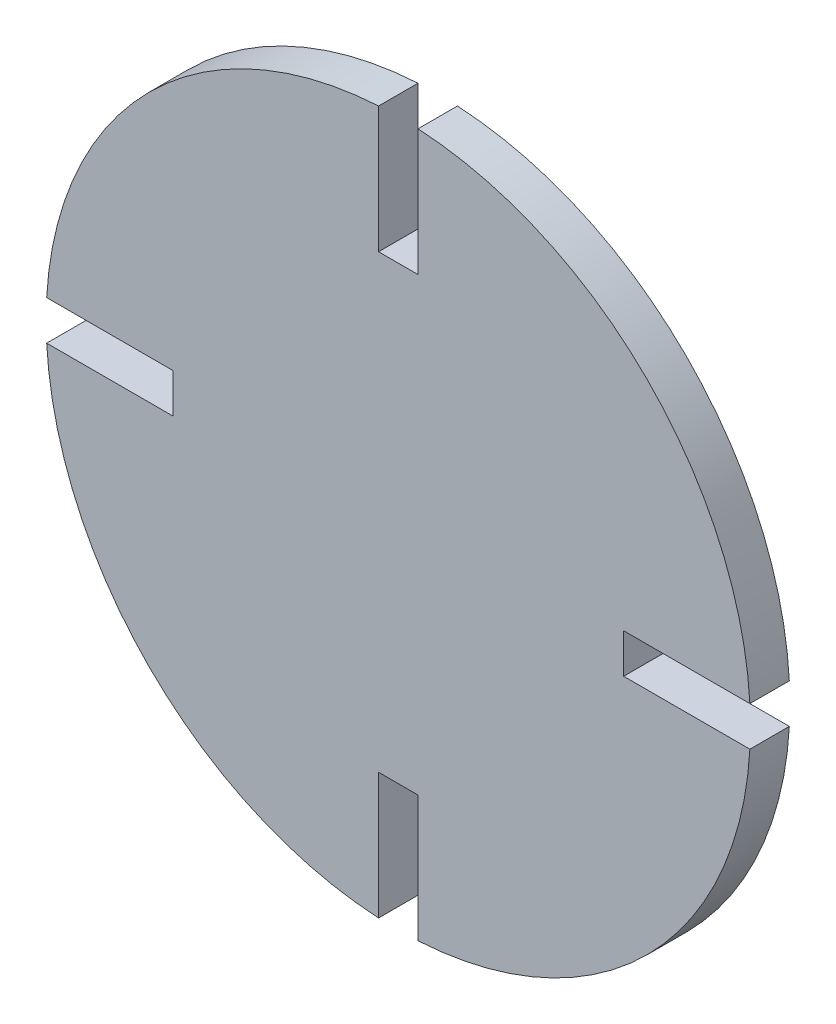
ISO-10303-21;
HEADER;
FILE_DESCRIPTION(('STEP AP214'),'2;1');
FILE_NAME('part.step','',(''),(''),'','','');
FILE_SCHEMA(('AUTOMOTIVE_DESIGN { 1 0 10303 214 1 1 1 1 }'));
ENDSEC;
DATA;
#1=APPLICATION_CONTEXT('core data for automotive mechanical design processes');
#2=APPLICATION_PROTOCOL_DEFINITION('international standard','automotive_design',2000,#1);
#3=PRODUCT_CONTEXT('',#1,'mechanical');
#4=PRODUCT('Part','Part','',(#3));
#5=PRODUCT_RELATED_PRODUCT_CATEGORY('part','',(#4));
#6=PRODUCT_DEFINITION_FORMATION('','',#4);
#7=PRODUCT_DEFINITION_CONTEXT('part definition',#1,'design');
#8=PRODUCT_DEFINITION('design','',#6,#7);
#9=PRODUCT_DEFINITION_SHAPE('','',#8);
#10=(LENGTH_UNIT() NAMED_UNIT(*) SI_UNIT(.MILLI.,.METRE.));
#11=(NAMED_UNIT(*) PLANE_ANGLE_UNIT() SI_UNIT($,.RADIAN.));
#12=(NAMED_UNIT(*) SI_UNIT($,.STERADIAN.) SOLID_ANGLE_UNIT());
#13=UNCERTAINTY_MEASURE_WITH_UNIT(LENGTH_MEASURE(1.E-05),#10,'distance_accuracy_value','');
#14=(GEOMETRIC_REPRESENTATION_CONTEXT(3) GLOBAL_UNCERTAINTY_ASSIGNED_CONTEXT((#13)) GLOBAL_UNIT_ASSIGNED_CONTEXT((#10,
#11,#12)) REPRESENTATION_CONTEXT('',''));
#15=CARTESIAN_POINT('',(0.,0.,0.));
#16=DIRECTION('',(0.,0.,1.));
#17=DIRECTION('',(1.,0.,0.));
#18=AXIS2_PLACEMENT_3D('',#15,#16,#17);
#19=CARTESIAN_POINT('',(0.,0.,2.8));
#20=DIRECTION('',(0.,0.,-1.));
#21=DIRECTION('',(-1.,0.,0.));
#22=AXIS2_PLACEMENT_3D('',#19,#20,#21);
#23=CYLINDRICAL_SURFACE('',#22,25.);
#24=DIRECTION('',(0.,0.,-1.));
#25=VECTOR('',#24,1.);
#26=CARTESIAN_POINT('',(-24.9607692189163,1.39999999999991,2.8));
#27=LINE('',#26,#25);
#28=CARTESIAN_POINT('',(-24.9607692189163,1.39999999999991,2.8));
#29=VERTEX_POINT('',#28);
#30=CARTESIAN_POINT('',(-24.9607692189163,1.39999999999991,0.));
#31=VERTEX_POINT('',#30);
#32=EDGE_CURVE('E215',#29,#31,#27,.T.);
#33=ORIENTED_EDGE('',*,*,#32,.F.);
#34=CARTESIAN_POINT('',(0.,0.,2.8));
#35=DIRECTION('',(0.,0.,1.));
#36=DIRECTION('',(1.,0.,0.));
#37=AXIS2_PLACEMENT_3D('',#34,#35,#36);
#38=CIRCLE('',#37,25.);
#39=CARTESIAN_POINT('',(-1.4,24.9607692189163,2.8));
#40=VERTEX_POINT('',#39);
#41=EDGE_CURVE('E241',#40,#29,#38,.T.);
#42=ORIENTED_EDGE('',*,*,#41,.F.);
#43=DIRECTION('',(0.,0.,-1.));
#44=VECTOR('',#43,1.);
#45=CARTESIAN_POINT('',(-1.4,24.9607692189163,2.8));
#46=LINE('',#45,#44);
#47=CARTESIAN_POINT('',(-1.4,24.9607692189163,0.));
#48=VERTEX_POINT('',#47);
#49=EDGE_CURVE('E235',#48,#40,#46,.F.);
#50=ORIENTED_EDGE('',*,*,#49,.F.);
#51=CARTESIAN_POINT('',(0.,0.,0.));
#52=DIRECTION('',(0.,0.,1.));
#53=DIRECTION('',(1.,0.,0.));
#54=AXIS2_PLACEMENT_3D('',#51,#52,#53);
#55=CIRCLE('',#54,25.);
#56=EDGE_CURVE('E246',#48,#31,#55,.T.);
#57=ORIENTED_EDGE('',*,*,#56,.T.);
#58=EDGE_LOOP('',(#33,#42,#50,#57));
#59=FACE_BOUND('',#58,.T.);
#60=ADVANCED_FACE('F33',(#59),#23,.T.);
#61=DIRECTION('',(0.,0.,-1.));
#62=VECTOR('',#61,1.);
#63=CARTESIAN_POINT('',(-24.9607692189163,-1.40000000000009,2.8));
#64=LINE('',#63,#62);
#65=CARTESIAN_POINT('',(-24.9607692189163,-1.40000000000009,0.));
#66=VERTEX_POINT('',#65);
#67=CARTESIAN_POINT('',(-24.9607692189163,-1.40000000000009,2.8));
#68=VERTEX_POINT('',#67);
#69=EDGE_CURVE('E151',#66,#68,#64,.F.);
#70=ORIENTED_EDGE('',*,*,#69,.F.);
#71=CARTESIAN_POINT('',(-1.4,-24.9607692189163,0.));
#72=VERTEX_POINT('',#71);
#73=EDGE_CURVE('E249',#66,#72,#55,.T.);
#74=ORIENTED_EDGE('',*,*,#73,.T.);
#75=DIRECTION('',(0.,0.,-1.));
#76=VECTOR('',#75,1.);
#77=CARTESIAN_POINT('',(-1.4,-24.9607692189163,2.8));
#78=LINE('',#77,#76);
#79=CARTESIAN_POINT('',(-1.4,-24.9607692189163,2.8));
#80=VERTEX_POINT('',#79);
#81=EDGE_CURVE('E212',#80,#72,#78,.T.);
#82=ORIENTED_EDGE('',*,*,#81,.F.);
#83=EDGE_CURVE('E244',#68,#80,#38,.T.);
#84=ORIENTED_EDGE('',*,*,#83,.F.);
#85=EDGE_LOOP('',(#70,#74,#82,#84));
#86=FACE_BOUND('',#85,.T.);
#87=ADVANCED_FACE('F297',(#86),#23,.T.);
#88=DIRECTION('',(0.,0.,-1.));
#89=VECTOR('',#88,1.);
#90=CARTESIAN_POINT('',(1.4,-24.9607692189163,2.8));
#91=LINE('',#90,#89);
#92=CARTESIAN_POINT('',(1.4,-24.9607692189163,0.));
#93=VERTEX_POINT('',#92);
#94=CARTESIAN_POINT('',(1.4,-24.9607692189163,2.8));
#95=VERTEX_POINT('',#94);
#96=EDGE_CURVE('E210',#93,#95,#91,.F.);
#97=ORIENTED_EDGE('',*,*,#96,.F.);
#98=CARTESIAN_POINT('',(24.9607692189163,-1.39999999999974,0.));
#99=VERTEX_POINT('',#98);
#100=EDGE_CURVE('E266',#93,#99,#55,.T.);
#101=ORIENTED_EDGE('',*,*,#100,.T.);
#102=DIRECTION('',(0.,0.,-1.));
#103=VECTOR('',#102,1.);
#104=CARTESIAN_POINT('',(24.9607692189163,-1.39999999999974,2.8));
#105=LINE('',#104,#103);
#106=CARTESIAN_POINT('',(24.9607692189163,-1.39999999999974,2.8));
#107=VERTEX_POINT('',#106);
#108=EDGE_CURVE('E208',#107,#99,#105,.T.);
#109=ORIENTED_EDGE('',*,*,#108,.F.);
#110=EDGE_CURVE('E268',#95,#107,#38,.T.);
#111=ORIENTED_EDGE('',*,*,#110,.F.);
#112=EDGE_LOOP('',(#97,#101,#109,#111));
#113=FACE_BOUND('',#112,.T.);
#114=ADVANCED_FACE('F264',(#113),#23,.T.);
#115=DIRECTION('',(0.,0.,-1.));
#116=VECTOR('',#115,1.);
#117=CARTESIAN_POINT('',(24.9607692189163,1.40000000000026,2.8));
#118=LINE('',#117,#116);
#119=CARTESIAN_POINT('',(24.9607692189163,1.40000000000026,0.));
#120=VERTEX_POINT('',#119);
#121=CARTESIAN_POINT('',(24.9607692189163,1.40000000000026,2.8));
#122=VERTEX_POINT('',#121);
#123=EDGE_CURVE('E164',#120,#122,#118,.F.);
#124=ORIENTED_EDGE('',*,*,#123,.F.);
#125=CARTESIAN_POINT('',(1.4,24.9607692189163,0.));
#126=VERTEX_POINT('',#125);
#127=EDGE_CURVE('E240',#120,#126,#55,.T.);
#128=ORIENTED_EDGE('',*,*,#127,.T.);
#129=DIRECTION('',(0.,0.,-1.));
#130=VECTOR('',#129,1.);
#131=CARTESIAN_POINT('',(1.4,24.9607692189163,2.8));
#132=LINE('',#131,#130);
#133=CARTESIAN_POINT('',(1.4,24.9607692189163,2.8));
#134=VERTEX_POINT('',#133);
#135=EDGE_CURVE('E237',#134,#126,#132,.T.);
#136=ORIENTED_EDGE('',*,*,#135,.F.);
#137=EDGE_CURVE('E245',#122,#134,#38,.T.);
#138=ORIENTED_EDGE('',*,*,#137,.F.);
#139=EDGE_LOOP('',(#124,#128,#136,#138));
#140=FACE_BOUND('',#139,.T.);
#141=ADVANCED_FACE('F275',(#140),#23,.T.);
#142=CARTESIAN_POINT('',(0.,0.,2.8));
#143=DIRECTION('',(0.,0.,1.));
#144=DIRECTION('',(1.,0.,0.));
#145=AXIS2_PLACEMENT_3D('',#142,#143,#144);
#146=PLANE('',#145);
#147=ORIENTED_EDGE('',*,*,#41,.T.);
#148=DIRECTION('',(-1.,0.,0.));
#149=VECTOR('',#148,1.);
#150=CARTESIAN_POINT('',(-34.,1.39999999999988,2.8));
#151=LINE('',#150,#149);
#152=CARTESIAN_POINT('',(-16.,1.39999999999995,2.8));
#153=VERTEX_POINT('',#152);
#154=EDGE_CURVE('E157',#153,#29,#151,.T.);
#155=ORIENTED_EDGE('',*,*,#154,.F.);
#156=DIRECTION('',(0.,1.,0.));
#157=VECTOR('',#156,1.);
#158=CARTESIAN_POINT('',(-16.,-1.40000000000005,2.8));
#159=LINE('',#158,#157);
#160=CARTESIAN_POINT('',(-16.,-1.40000000000005,2.8));
#161=VERTEX_POINT('',#160);
#162=EDGE_CURVE('E156',#161,#153,#159,.T.);
#163=ORIENTED_EDGE('',*,*,#162,.F.);
#164=DIRECTION('',(1.,0.,0.));
#165=VECTOR('',#164,1.);
#166=CARTESIAN_POINT('',(-34.,-1.40000000000012,2.8));
#167=LINE('',#166,#165);
#168=EDGE_CURVE('E145',#68,#161,#167,.T.);
#169=ORIENTED_EDGE('',*,*,#168,.F.);
#170=ORIENTED_EDGE('',*,*,#83,.T.);
#171=DIRECTION('',(0.,-1.,0.));
#172=VECTOR('',#171,1.);
#173=CARTESIAN_POINT('',(-1.4,-34.,2.8));
#174=LINE('',#173,#172);
#175=CARTESIAN_POINT('',(-1.4,-16.,2.8));
#176=VERTEX_POINT('',#175);
#177=EDGE_CURVE('E177',#176,#80,#174,.T.);
#178=ORIENTED_EDGE('',*,*,#177,.F.);
#179=DIRECTION('',(-1.,0.,0.));
#180=VECTOR('',#179,1.);
#181=CARTESIAN_POINT('',(1.4,-16.,2.8));
#182=LINE('',#181,#180);
#183=CARTESIAN_POINT('',(1.4,-16.,2.8));
#184=VERTEX_POINT('',#183);
#185=EDGE_CURVE('E182',#184,#176,#182,.T.);
#186=ORIENTED_EDGE('',*,*,#185,.F.);
#187=DIRECTION('',(0.,1.,0.));
#188=VECTOR('',#187,1.);
#189=CARTESIAN_POINT('',(1.4,-34.,2.8));
#190=LINE('',#189,#188);
#191=EDGE_CURVE('E179',#95,#184,#190,.T.);
#192=ORIENTED_EDGE('',*,*,#191,.F.);
#193=ORIENTED_EDGE('',*,*,#110,.T.);
#194=DIRECTION('',(1.,0.,0.));
#195=VECTOR('',#194,1.);
#196=CARTESIAN_POINT('',(34.,-1.39999999999964,2.8));
#197=LINE('',#196,#195);
#198=CARTESIAN_POINT('',(16.,-1.39999999999983,2.8));
#199=VERTEX_POINT('',#198);
#200=EDGE_CURVE('E191',#199,#107,#197,.T.);
#201=ORIENTED_EDGE('',*,*,#200,.F.);
#202=DIRECTION('',(0.,-1.,0.));
#203=VECTOR('',#202,1.);
#204=CARTESIAN_POINT('',(16.,1.40000000000017,2.8));
#205=LINE('',#204,#203);
#206=CARTESIAN_POINT('',(16.,1.40000000000017,2.8));
#207=VERTEX_POINT('',#206);
#208=EDGE_CURVE('E196',#207,#199,#205,.T.);
#209=ORIENTED_EDGE('',*,*,#208,.F.);
#210=DIRECTION('',(-1.,0.,0.));
#211=VECTOR('',#210,1.);
#212=CARTESIAN_POINT('',(34.,1.40000000000036,2.8));
#213=LINE('',#212,#211);
#214=EDGE_CURVE('E193',#122,#207,#213,.T.);
#215=ORIENTED_EDGE('',*,*,#214,.F.);
#216=ORIENTED_EDGE('',*,*,#137,.T.);
#217=DIRECTION('',(0.,1.,0.));
#218=VECTOR('',#217,1.);
#219=CARTESIAN_POINT('',(1.4,34.,2.8));
#220=LINE('',#219,#218);
#221=CARTESIAN_POINT('',(1.4,16.,2.8));
#222=VERTEX_POINT('',#221);
#223=EDGE_CURVE('E218',#222,#134,#220,.T.);
#224=ORIENTED_EDGE('',*,*,#223,.F.);
#225=DIRECTION('',(1.,0.,0.));
#226=VECTOR('',#225,1.);
#227=CARTESIAN_POINT('',(-1.4,16.,2.8));
#228=LINE('',#227,#226);
#229=CARTESIAN_POINT('',(-1.4,16.,2.8));
#230=VERTEX_POINT('',#229);
#231=EDGE_CURVE('E224',#230,#222,#228,.T.);
#232=ORIENTED_EDGE('',*,*,#231,.F.);
#233=DIRECTION('',(0.,-1.,0.));
#234=VECTOR('',#233,1.);
#235=CARTESIAN_POINT('',(-1.4,34.,2.8));
#236=LINE('',#235,#234);
#237=EDGE_CURVE('E221',#40,#230,#236,.T.);
#238=ORIENTED_EDGE('',*,*,#237,.F.);
#239=EDGE_LOOP('',(#147,#155,#163,#169,#170,#178,#186,#192,#193,#201,#209,#215,#216,#224,#232,#238));
#240=FACE_BOUND('',#239,.T.);
#241=ADVANCED_FACE('F169',(#240),#146,.T.);
#242=CARTESIAN_POINT('',(0.,0.,0.));
#243=DIRECTION('',(0.,0.,1.));
#244=DIRECTION('',(1.,0.,0.));
#245=AXIS2_PLACEMENT_3D('',#242,#243,#244);
#246=PLANE('',#245);
#247=DIRECTION('',(-1.,0.,0.));
#248=VECTOR('',#247,1.);
#249=CARTESIAN_POINT('',(-34.,1.39999999999988,0.));
#250=LINE('',#249,#248);
#251=CARTESIAN_POINT('',(-16.,1.39999999999995,0.));
#252=VERTEX_POINT('',#251);
#253=EDGE_CURVE('E47',#252,#31,#250,.T.);
#254=ORIENTED_EDGE('',*,*,#253,.T.);
#255=ORIENTED_EDGE('',*,*,#56,.F.);
#256=DIRECTION('',(0.,1.,0.));
#257=VECTOR('',#256,1.);
#258=CARTESIAN_POINT('',(-1.4,0.,0.));
#259=LINE('',#258,#257);
#260=CARTESIAN_POINT('',(-1.4,16.,0.));
#261=VERTEX_POINT('',#260);
#262=EDGE_CURVE('E243',#261,#48,#259,.T.);
#263=ORIENTED_EDGE('',*,*,#262,.F.);
#264=DIRECTION('',(1.,0.,0.));
#265=VECTOR('',#264,1.);
#266=CARTESIAN_POINT('',(-1.4,16.,0.));
#267=LINE('',#266,#265);
#268=CARTESIAN_POINT('',(1.4,16.,0.));
#269=VERTEX_POINT('',#268);
#270=EDGE_CURVE('E222',#261,#269,#267,.T.);
#271=ORIENTED_EDGE('',*,*,#270,.T.);
#272=DIRECTION('',(0.,1.,0.));
#273=VECTOR('',#272,1.);
#274=CARTESIAN_POINT('',(1.4,34.,0.));
#275=LINE('',#274,#273);
#276=EDGE_CURVE('E217',#269,#126,#275,.T.);
#277=ORIENTED_EDGE('',*,*,#276,.T.);
#278=ORIENTED_EDGE('',*,*,#127,.F.);
#279=DIRECTION('',(1.,0.,0.));
#280=VECTOR('',#279,1.);
#281=CARTESIAN_POINT('',(0.,1.4,0.));
#282=LINE('',#281,#280);
#283=CARTESIAN_POINT('',(16.,1.40000000000017,0.));
#284=VERTEX_POINT('',#283);
#285=EDGE_CURVE('E251',#284,#120,#282,.T.);
#286=ORIENTED_EDGE('',*,*,#285,.F.);
#287=DIRECTION('',(0.,-1.,0.));
#288=VECTOR('',#287,1.);
#289=CARTESIAN_POINT('',(16.,1.40000000000017,0.));
#290=LINE('',#289,#288);
#291=CARTESIAN_POINT('',(16.,-1.39999999999983,0.));
#292=VERTEX_POINT('',#291);
#293=EDGE_CURVE('E194',#284,#292,#290,.T.);
#294=ORIENTED_EDGE('',*,*,#293,.T.);
#295=DIRECTION('',(1.,0.,0.));
#296=VECTOR('',#295,1.);
#297=CARTESIAN_POINT('',(34.,-1.39999999999964,0.));
#298=LINE('',#297,#296);
#299=EDGE_CURVE('E199',#292,#99,#298,.T.);
#300=ORIENTED_EDGE('',*,*,#299,.T.);
#301=ORIENTED_EDGE('',*,*,#100,.F.);
#302=DIRECTION('',(0.,-1.,0.));
#303=VECTOR('',#302,1.);
#304=CARTESIAN_POINT('',(1.4,0.,0.));
#305=LINE('',#304,#303);
#306=CARTESIAN_POINT('',(1.4,-16.,0.));
#307=VERTEX_POINT('',#306);
#308=EDGE_CURVE('E40',#307,#93,#305,.T.);
#309=ORIENTED_EDGE('',*,*,#308,.F.);
#310=DIRECTION('',(-1.,0.,0.));
#311=VECTOR('',#310,1.);
#312=CARTESIAN_POINT('',(1.4,-16.,0.));
#313=LINE('',#312,#311);
#314=CARTESIAN_POINT('',(-1.4,-16.,0.));
#315=VERTEX_POINT('',#314);
#316=EDGE_CURVE('E180',#307,#315,#313,.T.);
#317=ORIENTED_EDGE('',*,*,#316,.T.);
#318=DIRECTION('',(0.,-1.,0.));
#319=VECTOR('',#318,1.);
#320=CARTESIAN_POINT('',(-1.4,-34.,0.));
#321=LINE('',#320,#319);
#322=EDGE_CURVE('E55',#315,#72,#321,.T.);
#323=ORIENTED_EDGE('',*,*,#322,.T.);
#324=ORIENTED_EDGE('',*,*,#73,.F.);
#325=DIRECTION('',(-1.,0.,0.));
#326=VECTOR('',#325,1.);
#327=CARTESIAN_POINT('',(0.,-1.4,0.));
#328=LINE('',#327,#326);
#329=CARTESIAN_POINT('',(-16.,-1.40000000000005,0.));
#330=VERTEX_POINT('',#329);
#331=EDGE_CURVE('E11',#330,#66,#328,.T.);
#332=ORIENTED_EDGE('',*,*,#331,.F.);
#333=DIRECTION('',(0.,1.,0.));
#334=VECTOR('',#333,1.);
#335=CARTESIAN_POINT('',(-16.,-1.40000000000005,0.));
#336=LINE('',#335,#334);
#337=EDGE_CURVE('E162',#330,#252,#336,.T.);
#338=ORIENTED_EDGE('',*,*,#337,.T.);
#339=EDGE_LOOP('',(#254,#255,#263,#271,#277,#278,#286,#294,#300,#301,#309,#317,#323,#324,#332,#338));
#340=FACE_BOUND('',#339,.T.);
#341=ADVANCED_FACE('F269',(#340),#246,.F.);
#342=CARTESIAN_POINT('',(1.4,34.,2.8));
#343=DIRECTION('',(-1.,0.,0.));
#344=DIRECTION('',(0.,-1.,0.));
#345=AXIS2_PLACEMENT_3D('',#342,#343,#344);
#346=PLANE('',#345);
#347=ORIENTED_EDGE('',*,*,#135,.T.);
#348=ORIENTED_EDGE('',*,*,#276,.F.);
#349=DIRECTION('',(0.,0.,-1.));
#350=VECTOR('',#349,1.);
#351=CARTESIAN_POINT('',(1.4,16.,2.8));
#352=LINE('',#351,#350);
#353=EDGE_CURVE('E226',#222,#269,#352,.T.);
#354=ORIENTED_EDGE('',*,*,#353,.F.);
#355=ORIENTED_EDGE('',*,*,#223,.T.);
#356=EDGE_LOOP('',(#347,#348,#354,#355));
#357=FACE_BOUND('',#356,.T.);
#358=ADVANCED_FACE('F279',(#357),#346,.T.);
#359=CARTESIAN_POINT('',(-1.4,34.,2.8));
#360=DIRECTION('',(1.,0.,0.));
#361=DIRECTION('',(0.,1.,0.));
#362=AXIS2_PLACEMENT_3D('',#359,#360,#361);
#363=PLANE('',#362);
#364=ORIENTED_EDGE('',*,*,#49,.T.);
#365=ORIENTED_EDGE('',*,*,#237,.T.);
#366=DIRECTION('',(0.,0.,-1.));
#367=VECTOR('',#366,1.);
#368=CARTESIAN_POINT('',(-1.4,16.,2.8));
#369=LINE('',#368,#367);
#370=EDGE_CURVE('E233',#230,#261,#369,.T.);
#371=ORIENTED_EDGE('',*,*,#370,.T.);
#372=ORIENTED_EDGE('',*,*,#262,.T.);
#373=EDGE_LOOP('',(#364,#365,#371,#372));
#374=FACE_BOUND('',#373,.T.);
#375=ADVANCED_FACE('F344',(#374),#363,.T.);
#376=CARTESIAN_POINT('',(-1.4,16.,2.8));
#377=DIRECTION('',(0.,1.,0.));
#378=DIRECTION('',(0.,0.,1.));
#379=AXIS2_PLACEMENT_3D('',#376,#377,#378);
#380=PLANE('',#379);
#381=ORIENTED_EDGE('',*,*,#270,.F.);
#382=ORIENTED_EDGE('',*,*,#370,.F.);
#383=ORIENTED_EDGE('',*,*,#231,.T.);
#384=ORIENTED_EDGE('',*,*,#353,.T.);
#385=EDGE_LOOP('',(#381,#382,#383,#384));
#386=FACE_BOUND('',#385,.T.);
#387=ADVANCED_FACE('F287',(#386),#380,.T.);
#388=CARTESIAN_POINT('',(34.,-1.39999999999964,2.8));
#389=DIRECTION('',(0.,1.,0.));
#390=DIRECTION('',(-1.,0.,0.));
#391=AXIS2_PLACEMENT_3D('',#388,#389,#390);
#392=PLANE('',#391);
#393=ORIENTED_EDGE('',*,*,#108,.T.);
#394=ORIENTED_EDGE('',*,*,#299,.F.);
#395=DIRECTION('',(0.,0.,-1.));
#396=VECTOR('',#395,1.);
#397=CARTESIAN_POINT('',(16.,-1.39999999999983,2.8));
#398=LINE('',#397,#396);
#399=EDGE_CURVE('E198',#199,#292,#398,.T.);
#400=ORIENTED_EDGE('',*,*,#399,.F.);
#401=ORIENTED_EDGE('',*,*,#200,.T.);
#402=EDGE_LOOP('',(#393,#394,#400,#401));
#403=FACE_BOUND('',#402,.T.);
#404=ADVANCED_FACE('F343',(#403),#392,.T.);
#405=CARTESIAN_POINT('',(34.,1.40000000000036,2.8));
#406=DIRECTION('',(0.,-1.,0.));
#407=DIRECTION('',(1.,0.,0.));
#408=AXIS2_PLACEMENT_3D('',#405,#406,#407);
#409=PLANE('',#408);
#410=ORIENTED_EDGE('',*,*,#123,.T.);
#411=ORIENTED_EDGE('',*,*,#214,.T.);
#412=DIRECTION('',(0.,0.,-1.));
#413=VECTOR('',#412,1.);
#414=CARTESIAN_POINT('',(16.,1.40000000000017,2.8));
#415=LINE('',#414,#413);
#416=EDGE_CURVE('E186',#207,#284,#415,.T.);
#417=ORIENTED_EDGE('',*,*,#416,.T.);
#418=ORIENTED_EDGE('',*,*,#285,.T.);
#419=EDGE_LOOP('',(#410,#411,#417,#418));
#420=FACE_BOUND('',#419,.T.);
#421=ADVANCED_FACE('F388',(#420),#409,.T.);
#422=CARTESIAN_POINT('',(16.,1.40000000000017,2.8));
#423=DIRECTION('',(1.,0.,0.));
#424=DIRECTION('',(0.,1.,0.));
#425=AXIS2_PLACEMENT_3D('',#422,#423,#424);
#426=PLANE('',#425);
#427=ORIENTED_EDGE('',*,*,#293,.F.);
#428=ORIENTED_EDGE('',*,*,#416,.F.);
#429=ORIENTED_EDGE('',*,*,#208,.T.);
#430=ORIENTED_EDGE('',*,*,#399,.T.);
#431=EDGE_LOOP('',(#427,#428,#429,#430));
#432=FACE_BOUND('',#431,.T.);
#433=ADVANCED_FACE('F398',(#432),#426,.T.);
#434=CARTESIAN_POINT('',(-1.4,-34.,2.8));
#435=DIRECTION('',(1.,0.,0.));
#436=DIRECTION('',(0.,1.,0.));
#437=AXIS2_PLACEMENT_3D('',#434,#435,#436);
#438=PLANE('',#437);
#439=ORIENTED_EDGE('',*,*,#81,.T.);
#440=ORIENTED_EDGE('',*,*,#322,.F.);
#441=DIRECTION('',(0.,0.,-1.));
#442=VECTOR('',#441,1.);
#443=CARTESIAN_POINT('',(-1.4,-16.,2.8));
#444=LINE('',#443,#442);
#445=EDGE_CURVE('E184',#176,#315,#444,.T.);
#446=ORIENTED_EDGE('',*,*,#445,.F.);
#447=ORIENTED_EDGE('',*,*,#177,.T.);
#448=EDGE_LOOP('',(#439,#440,#446,#447));
#449=FACE_BOUND('',#448,.T.);
#450=ADVANCED_FACE('F299',(#449),#438,.T.);
#451=CARTESIAN_POINT('',(1.4,-34.,2.8));
#452=DIRECTION('',(-1.,0.,0.));
#453=DIRECTION('',(0.,-1.,0.));
#454=AXIS2_PLACEMENT_3D('',#451,#452,#453);
#455=PLANE('',#454);
#456=ORIENTED_EDGE('',*,*,#96,.T.);
#457=ORIENTED_EDGE('',*,*,#191,.T.);
#458=DIRECTION('',(0.,0.,-1.));
#459=VECTOR('',#458,1.);
#460=CARTESIAN_POINT('',(1.4,-16.,2.8));
#461=LINE('',#460,#459);
#462=EDGE_CURVE('E175',#184,#307,#461,.T.);
#463=ORIENTED_EDGE('',*,*,#462,.T.);
#464=ORIENTED_EDGE('',*,*,#308,.T.);
#465=EDGE_LOOP('',(#456,#457,#463,#464));
#466=FACE_BOUND('',#465,.T.);
#467=ADVANCED_FACE('F255',(#466),#455,.T.);
#468=CARTESIAN_POINT('',(1.4,-16.,2.8));
#469=DIRECTION('',(0.,-1.,0.));
#470=DIRECTION('',(0.,0.,-1.));
#471=AXIS2_PLACEMENT_3D('',#468,#469,#470);
#472=PLANE('',#471);
#473=ORIENTED_EDGE('',*,*,#316,.F.);
#474=ORIENTED_EDGE('',*,*,#462,.F.);
#475=ORIENTED_EDGE('',*,*,#185,.T.);
#476=ORIENTED_EDGE('',*,*,#445,.T.);
#477=EDGE_LOOP('',(#473,#474,#475,#476));
#478=FACE_BOUND('',#477,.T.);
#479=ADVANCED_FACE('F301',(#478),#472,.T.);
#480=CARTESIAN_POINT('',(-34.,1.39999999999988,2.8));
#481=DIRECTION('',(0.,-1.,0.));
#482=DIRECTION('',(1.,0.,0.));
#483=AXIS2_PLACEMENT_3D('',#480,#481,#482);
#484=PLANE('',#483);
#485=ORIENTED_EDGE('',*,*,#32,.T.);
#486=ORIENTED_EDGE('',*,*,#253,.F.);
#487=DIRECTION('',(0.,0.,-1.));
#488=VECTOR('',#487,1.);
#489=CARTESIAN_POINT('',(-16.,1.39999999999995,2.8));
#490=LINE('',#489,#488);
#491=EDGE_CURVE('E165',#153,#252,#490,.T.);
#492=ORIENTED_EDGE('',*,*,#491,.F.);
#493=ORIENTED_EDGE('',*,*,#154,.T.);
#494=EDGE_LOOP('',(#485,#486,#492,#493));
#495=FACE_BOUND('',#494,.T.);
#496=ADVANCED_FACE('F303',(#495),#484,.T.);
#497=CARTESIAN_POINT('',(-34.,-1.40000000000012,2.8));
#498=DIRECTION('',(0.,1.,0.));
#499=DIRECTION('',(-1.,0.,0.));
#500=AXIS2_PLACEMENT_3D('',#497,#498,#499);
#501=PLANE('',#500);
#502=ORIENTED_EDGE('',*,*,#69,.T.);
#503=ORIENTED_EDGE('',*,*,#168,.T.);
#504=DIRECTION('',(0.,0.,-1.));
#505=VECTOR('',#504,1.);
#506=CARTESIAN_POINT('',(-16.,-1.40000000000005,2.8));
#507=LINE('',#506,#505);
#508=EDGE_CURVE('E148',#161,#330,#507,.T.);
#509=ORIENTED_EDGE('',*,*,#508,.T.);
#510=ORIENTED_EDGE('',*,*,#331,.T.);
#511=EDGE_LOOP('',(#502,#503,#509,#510));
#512=FACE_BOUND('',#511,.T.);
#513=ADVANCED_FACE('F147',(#512),#501,.T.);
#514=CARTESIAN_POINT('',(-16.,-1.40000000000005,2.8));
#515=DIRECTION('',(-1.,0.,0.));
#516=DIRECTION('',(0.,-1.,0.));
#517=AXIS2_PLACEMENT_3D('',#514,#515,#516);
#518=PLANE('',#517);
#519=ORIENTED_EDGE('',*,*,#337,.F.);
#520=ORIENTED_EDGE('',*,*,#508,.F.);
#521=ORIENTED_EDGE('',*,*,#162,.T.);
#522=ORIENTED_EDGE('',*,*,#491,.T.);
#523=EDGE_LOOP('',(#519,#520,#521,#522));
#524=FACE_BOUND('',#523,.T.);
#525=ADVANCED_FACE('F160',(#524),#518,.T.);
#526=CLOSED_SHELL('',(#60,#87,#114,#141,#241,#341,#358,#375,#387,#404,#421,#433,#450,#467,#479,
#496,#513,#525));
#527=MANIFOLD_SOLID_BREP('B2',#526);
#528=ADVANCED_BREP_SHAPE_REPRESENTATION('',(#18,#527),#14);
#529=SHAPE_DEFINITION_REPRESENTATION(#9,#528);
ENDSEC;
END-ISO-10303-21;
